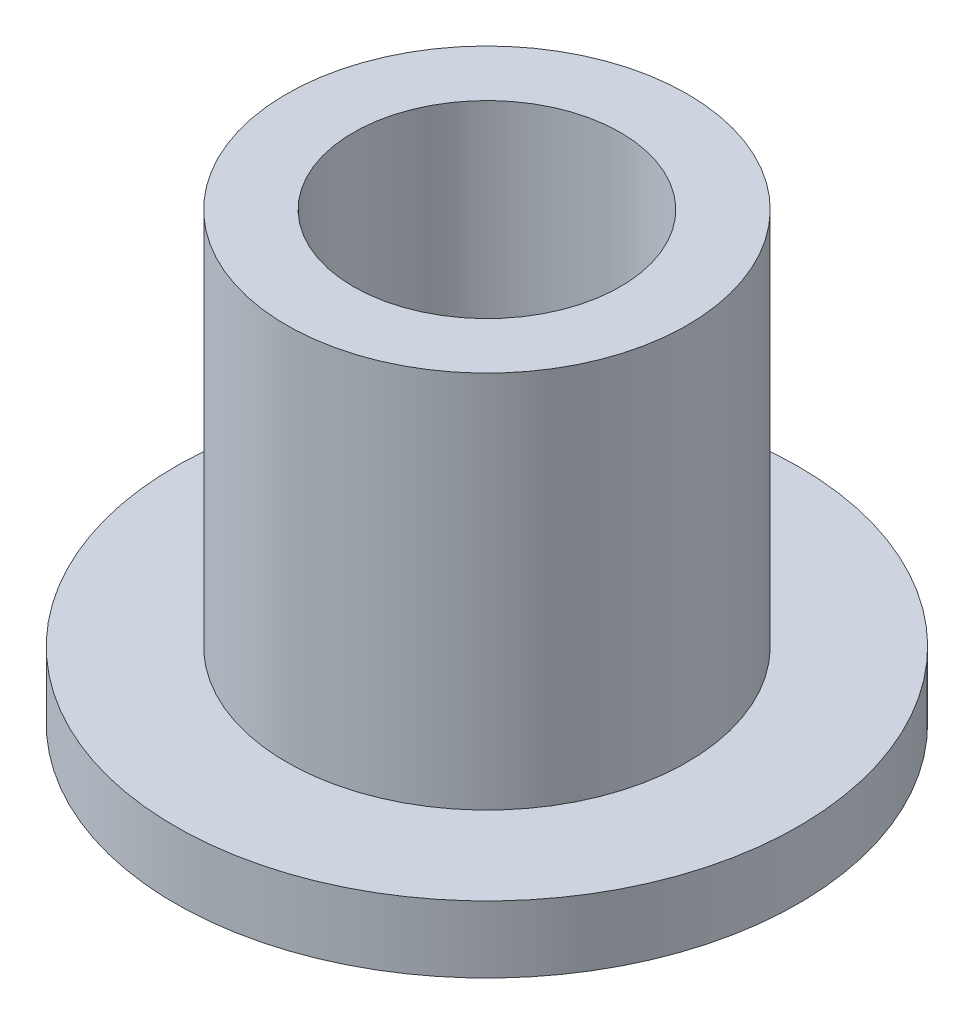
ISO-10303-21;
HEADER;
FILE_DESCRIPTION(('STEP AP214'),'2;1');
FILE_NAME('part.step','',(''),(''),'','','');
FILE_SCHEMA(('AUTOMOTIVE_DESIGN { 1 0 10303 214 1 1 1 1 }'));
ENDSEC;
DATA;
#1=APPLICATION_CONTEXT('core data for automotive mechanical design processes');
#2=APPLICATION_PROTOCOL_DEFINITION('international standard','automotive_design',2000,#1);
#3=PRODUCT_CONTEXT('',#1,'mechanical');
#4=PRODUCT('Part','Part','',(#3));
#5=PRODUCT_RELATED_PRODUCT_CATEGORY('part','',(#4));
#6=PRODUCT_DEFINITION_FORMATION('','',#4);
#7=PRODUCT_DEFINITION_CONTEXT('part definition',#1,'design');
#8=PRODUCT_DEFINITION('design','',#6,#7);
#9=PRODUCT_DEFINITION_SHAPE('','',#8);
#10=(LENGTH_UNIT() NAMED_UNIT(*) SI_UNIT(.MILLI.,.METRE.));
#11=(NAMED_UNIT(*) PLANE_ANGLE_UNIT() SI_UNIT($,.RADIAN.));
#12=(NAMED_UNIT(*) SI_UNIT($,.STERADIAN.) SOLID_ANGLE_UNIT());
#13=UNCERTAINTY_MEASURE_WITH_UNIT(LENGTH_MEASURE(1.E-05),#10,'distance_accuracy_value','');
#14=(GEOMETRIC_REPRESENTATION_CONTEXT(3) GLOBAL_UNCERTAINTY_ASSIGNED_CONTEXT((#13)) GLOBAL_UNIT_ASSIGNED_CONTEXT((#10,
#11,#12)) REPRESENTATION_CONTEXT('',''));
#15=CARTESIAN_POINT('',(0.,0.,0.));
#16=DIRECTION('',(0.,0.,1.));
#17=DIRECTION('',(1.,0.,0.));
#18=AXIS2_PLACEMENT_3D('',#15,#16,#17);
#19=CARTESIAN_POINT('',(0.,0.,0.));
#20=DIRECTION('',(0.,-1.,0.));
#21=DIRECTION('',(0.,0.,-1.));
#22=AXIS2_PLACEMENT_3D('',#19,#20,#21);
#23=CYLINDRICAL_SURFACE('',#22,3.5);
#24=CARTESIAN_POINT('',(0.,0.75,0.));
#25=DIRECTION('',(0.,-1.,0.));
#26=DIRECTION('',(0.,0.,-1.));
#27=AXIS2_PLACEMENT_3D('',#24,#25,#26);
#28=CIRCLE('',#27,3.5);
#29=CARTESIAN_POINT('',(0.,0.75,-3.5));
#30=VERTEX_POINT('',#29);
#31=EDGE_CURVE('E10',#30,#30,#28,.T.);
#32=ORIENTED_EDGE('',*,*,#31,.T.);
#33=EDGE_LOOP('',(#32));
#34=FACE_BOUND('',#33,.T.);
#35=CARTESIAN_POINT('',(0.,0.,0.));
#36=DIRECTION('',(0.,-1.,0.));
#37=DIRECTION('',(0.,0.,-1.));
#38=AXIS2_PLACEMENT_3D('',#35,#36,#37);
#39=CIRCLE('',#38,3.5);
#40=CARTESIAN_POINT('',(0.,0.,-3.5));
#41=VERTEX_POINT('',#40);
#42=EDGE_CURVE('E53',#41,#41,#39,.T.);
#43=ORIENTED_EDGE('',*,*,#42,.F.);
#44=EDGE_LOOP('',(#43));
#45=FACE_BOUND('',#44,.T.);
#46=ADVANCED_FACE('F31',(#34,#45),#23,.T.);
#47=CARTESIAN_POINT('',(3.5,0.75,0.));
#48=DIRECTION('',(0.,1.,0.));
#49=DIRECTION('',(0.,0.,1.));
#50=AXIS2_PLACEMENT_3D('',#47,#48,#49);
#51=PLANE('',#50);
#52=CARTESIAN_POINT('',(0.,0.75,0.));
#53=DIRECTION('',(0.,-1.,0.));
#54=DIRECTION('',(0.,0.,-1.));
#55=AXIS2_PLACEMENT_3D('',#52,#53,#54);
#56=CIRCLE('',#55,2.25);
#57=CARTESIAN_POINT('',(0.,0.75,-2.25));
#58=VERTEX_POINT('',#57);
#59=EDGE_CURVE('E37',#58,#58,#56,.T.);
#60=ORIENTED_EDGE('',*,*,#59,.T.);
#61=EDGE_LOOP('',(#60));
#62=FACE_BOUND('',#61,.T.);
#63=ORIENTED_EDGE('',*,*,#31,.F.);
#64=EDGE_LOOP('',(#63));
#65=FACE_BOUND('',#64,.T.);
#66=ADVANCED_FACE('F61',(#62,#65),#51,.T.);
#67=CARTESIAN_POINT('',(0.,0.,0.));
#68=DIRECTION('',(0.,-1.,0.));
#69=DIRECTION('',(0.,0.,-1.));
#70=AXIS2_PLACEMENT_3D('',#67,#68,#69);
#71=CYLINDRICAL_SURFACE('',#70,2.25);
#72=CARTESIAN_POINT('',(0.,5.,0.));
#73=DIRECTION('',(0.,-1.,0.));
#74=DIRECTION('',(0.,0.,-1.));
#75=AXIS2_PLACEMENT_3D('',#72,#73,#74);
#76=CIRCLE('',#75,2.25);
#77=CARTESIAN_POINT('',(0.,5.,-2.25));
#78=VERTEX_POINT('',#77);
#79=EDGE_CURVE('E41',#78,#78,#76,.T.);
#80=ORIENTED_EDGE('',*,*,#79,.T.);
#81=EDGE_LOOP('',(#80));
#82=FACE_BOUND('',#81,.T.);
#83=ORIENTED_EDGE('',*,*,#59,.F.);
#84=EDGE_LOOP('',(#83));
#85=FACE_BOUND('',#84,.T.);
#86=ADVANCED_FACE('F65',(#82,#85),#71,.T.);
#87=CARTESIAN_POINT('',(2.25,5.,0.));
#88=DIRECTION('',(0.,1.,0.));
#89=DIRECTION('',(0.,0.,1.));
#90=AXIS2_PLACEMENT_3D('',#87,#88,#89);
#91=PLANE('',#90);
#92=CARTESIAN_POINT('',(0.,5.,0.));
#93=DIRECTION('',(0.,-1.,0.));
#94=DIRECTION('',(0.,0.,-1.));
#95=AXIS2_PLACEMENT_3D('',#92,#93,#94);
#96=CIRCLE('',#95,1.5);
#97=CARTESIAN_POINT('',(0.,5.,-1.5));
#98=VERTEX_POINT('',#97);
#99=EDGE_CURVE('E45',#98,#98,#96,.T.);
#100=ORIENTED_EDGE('',*,*,#99,.T.);
#101=EDGE_LOOP('',(#100));
#102=FACE_BOUND('',#101,.T.);
#103=ORIENTED_EDGE('',*,*,#79,.F.);
#104=EDGE_LOOP('',(#103));
#105=FACE_BOUND('',#104,.T.);
#106=ADVANCED_FACE('F69',(#102,#105),#91,.T.);
#107=CARTESIAN_POINT('',(0.,0.,0.));
#108=DIRECTION('',(0.,-1.,0.));
#109=DIRECTION('',(0.,0.,-1.));
#110=AXIS2_PLACEMENT_3D('',#107,#108,#109);
#111=CYLINDRICAL_SURFACE('',#110,1.5);
#112=CARTESIAN_POINT('',(0.,0.,0.));
#113=DIRECTION('',(0.,-1.,0.));
#114=DIRECTION('',(0.,0.,-1.));
#115=AXIS2_PLACEMENT_3D('',#112,#113,#114);
#116=CIRCLE('',#115,1.5);
#117=CARTESIAN_POINT('',(0.,0.,-1.5));
#118=VERTEX_POINT('',#117);
#119=EDGE_CURVE('E50',#118,#118,#116,.T.);
#120=ORIENTED_EDGE('',*,*,#119,.T.);
#121=EDGE_LOOP('',(#120));
#122=FACE_BOUND('',#121,.T.);
#123=ORIENTED_EDGE('',*,*,#99,.F.);
#124=EDGE_LOOP('',(#123));
#125=FACE_BOUND('',#124,.T.);
#126=ADVANCED_FACE('F76',(#122,#125),#111,.F.);
#127=CARTESIAN_POINT('',(1.5,0.,0.));
#128=DIRECTION('',(0.,-1.,0.));
#129=DIRECTION('',(0.,0.,-1.));
#130=AXIS2_PLACEMENT_3D('',#127,#128,#129);
#131=PLANE('',#130);
#132=ORIENTED_EDGE('',*,*,#42,.T.);
#133=EDGE_LOOP('',(#132));
#134=FACE_BOUND('',#133,.T.);
#135=ORIENTED_EDGE('',*,*,#119,.F.);
#136=EDGE_LOOP('',(#135));
#137=FACE_BOUND('',#136,.T.);
#138=ADVANCED_FACE('F57',(#134,#137),#131,.T.);
#139=CLOSED_SHELL('',(#46,#66,#86,#106,#126,#138));
#140=MANIFOLD_SOLID_BREP('B2',#139);
#141=ADVANCED_BREP_SHAPE_REPRESENTATION('',(#18,#140),#14);
#142=SHAPE_DEFINITION_REPRESENTATION(#9,#141);
ENDSEC;
END-ISO-10303-21;
